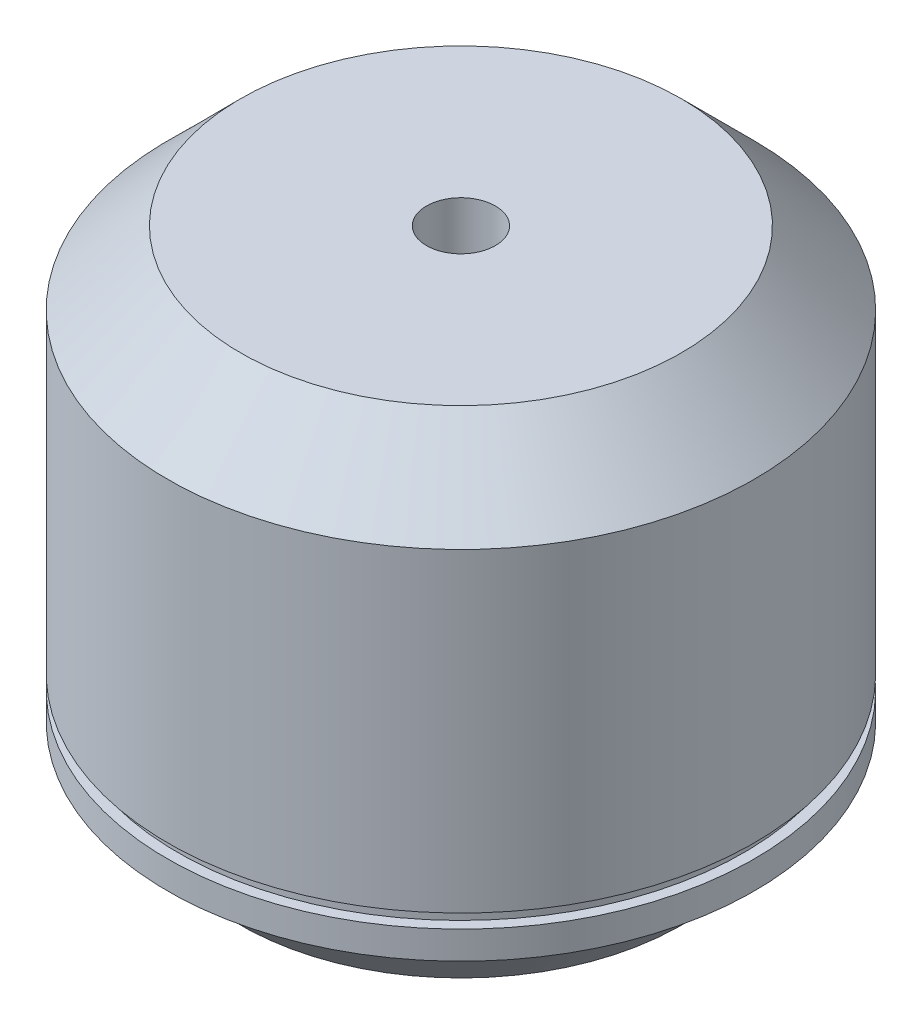
ISO-10303-21;
HEADER;
FILE_DESCRIPTION(('STEP AP214'),'2;1');
FILE_NAME('part.step','',(''),(''),'','','');
FILE_SCHEMA(('AUTOMOTIVE_DESIGN { 1 0 10303 214 1 1 1 1 }'));
ENDSEC;
DATA;
#1=APPLICATION_CONTEXT('core data for automotive mechanical design processes');
#2=APPLICATION_PROTOCOL_DEFINITION('international standard','automotive_design',2000,#1);
#3=PRODUCT_CONTEXT('',#1,'mechanical');
#4=PRODUCT('Part','Part','',(#3));
#5=PRODUCT_RELATED_PRODUCT_CATEGORY('part','',(#4));
#6=PRODUCT_DEFINITION_FORMATION('','',#4);
#7=PRODUCT_DEFINITION_CONTEXT('part definition',#1,'design');
#8=PRODUCT_DEFINITION('design','',#6,#7);
#9=PRODUCT_DEFINITION_SHAPE('','',#8);
#10=(LENGTH_UNIT() NAMED_UNIT(*) SI_UNIT(.MILLI.,.METRE.));
#11=(NAMED_UNIT(*) PLANE_ANGLE_UNIT() SI_UNIT($,.RADIAN.));
#12=(NAMED_UNIT(*) SI_UNIT($,.STERADIAN.) SOLID_ANGLE_UNIT());
#13=UNCERTAINTY_MEASURE_WITH_UNIT(LENGTH_MEASURE(1.E-05),#10,'distance_accuracy_value','');
#14=(GEOMETRIC_REPRESENTATION_CONTEXT(3) GLOBAL_UNCERTAINTY_ASSIGNED_CONTEXT((#13)) GLOBAL_UNIT_ASSIGNED_CONTEXT((#10,
#11,#12)) REPRESENTATION_CONTEXT('',''));
#15=CARTESIAN_POINT('',(0.,0.,0.));
#16=DIRECTION('',(0.,0.,1.));
#17=DIRECTION('',(1.,0.,0.));
#18=AXIS2_PLACEMENT_3D('',#15,#16,#17);
#19=CARTESIAN_POINT('',(16.,36.,0.));
#20=DIRECTION('',(0.,1.,0.));
#21=DIRECTION('',(0.,0.,1.));
#22=AXIS2_PLACEMENT_3D('',#19,#20,#21);
#23=PLANE('',#22);
#24=CARTESIAN_POINT('',(0.,36.,0.));
#25=DIRECTION('',(0.,-1.,0.));
#26=DIRECTION('',(0.,0.,-1.));
#27=AXIS2_PLACEMENT_3D('',#24,#25,#26);
#28=CIRCLE('',#27,2.5);
#29=CARTESIAN_POINT('',(0.,36.,-2.5));
#30=VERTEX_POINT('',#29);
#31=EDGE_CURVE('E10',#30,#30,#28,.T.);
#32=ORIENTED_EDGE('',*,*,#31,.T.);
#33=EDGE_LOOP('',(#32));
#34=FACE_BOUND('',#33,.T.);
#35=CARTESIAN_POINT('',(0.,36.,0.));
#36=DIRECTION('',(0.,-1.,0.));
#37=DIRECTION('',(0.,0.,-1.));
#38=AXIS2_PLACEMENT_3D('',#35,#36,#37);
#39=CIRCLE('',#38,16.);
#40=CARTESIAN_POINT('',(0.,36.,-16.));
#41=VERTEX_POINT('',#40);
#42=EDGE_CURVE('E73',#41,#41,#39,.T.);
#43=ORIENTED_EDGE('',*,*,#42,.F.);
#44=EDGE_LOOP('',(#43));
#45=FACE_BOUND('',#44,.T.);
#46=ADVANCED_FACE('F30',(#34,#45),#23,.T.);
#47=CARTESIAN_POINT('',(0.,0.,0.));
#48=DIRECTION('',(0.,-1.,0.));
#49=DIRECTION('',(0.,0.,-1.));
#50=AXIS2_PLACEMENT_3D('',#47,#48,#49);
#51=CYLINDRICAL_SURFACE('',#50,2.5);
#52=CARTESIAN_POINT('',(0.,1.,0.));
#53=DIRECTION('',(0.,-1.,0.));
#54=DIRECTION('',(0.,0.,-1.));
#55=AXIS2_PLACEMENT_3D('',#52,#53,#54);
#56=CIRCLE('',#55,2.5);
#57=CARTESIAN_POINT('',(0.,1.,-2.5));
#58=VERTEX_POINT('',#57);
#59=EDGE_CURVE('E36',#58,#58,#56,.T.);
#60=ORIENTED_EDGE('',*,*,#59,.T.);
#61=EDGE_LOOP('',(#60));
#62=FACE_BOUND('',#61,.T.);
#63=ORIENTED_EDGE('',*,*,#31,.F.);
#64=EDGE_LOOP('',(#63));
#65=FACE_BOUND('',#64,.T.);
#66=ADVANCED_FACE('F131',(#62,#65),#51,.F.);
#67=CARTESIAN_POINT('',(2.5,1.,0.));
#68=DIRECTION('',(0.,-1.,0.));
#69=DIRECTION('',(0.,0.,-1.));
#70=AXIS2_PLACEMENT_3D('',#67,#68,#69);
#71=PLANE('',#70);
#72=CARTESIAN_POINT('',(0.,1.,0.));
#73=DIRECTION('',(0.,-1.,0.));
#74=DIRECTION('',(0.,0.,-1.));
#75=AXIS2_PLACEMENT_3D('',#72,#73,#74);
#76=CIRCLE('',#75,8.);
#77=CARTESIAN_POINT('',(0.,1.,-8.));
#78=VERTEX_POINT('',#77);
#79=EDGE_CURVE('E40',#78,#78,#76,.T.);
#80=ORIENTED_EDGE('',*,*,#79,.T.);
#81=EDGE_LOOP('',(#80));
#82=FACE_BOUND('',#81,.T.);
#83=ORIENTED_EDGE('',*,*,#59,.F.);
#84=EDGE_LOOP('',(#83));
#85=FACE_BOUND('',#84,.T.);
#86=ADVANCED_FACE('F125',(#82,#85),#71,.T.);
#87=CARTESIAN_POINT('',(0.,0.,0.));
#88=DIRECTION('',(0.,-1.,0.));
#89=DIRECTION('',(0.,0.,-1.));
#90=AXIS2_PLACEMENT_3D('',#87,#88,#89);
#91=CYLINDRICAL_SURFACE('',#90,8.);
#92=CARTESIAN_POINT('',(0.,0.,0.));
#93=DIRECTION('',(0.,-1.,0.));
#94=DIRECTION('',(0.,0.,-1.));
#95=AXIS2_PLACEMENT_3D('',#92,#93,#94);
#96=CIRCLE('',#95,8.);
#97=CARTESIAN_POINT('',(0.,0.,-8.));
#98=VERTEX_POINT('',#97);
#99=EDGE_CURVE('E44',#98,#98,#96,.T.);
#100=ORIENTED_EDGE('',*,*,#99,.T.);
#101=EDGE_LOOP('',(#100));
#102=FACE_BOUND('',#101,.T.);
#103=ORIENTED_EDGE('',*,*,#79,.F.);
#104=EDGE_LOOP('',(#103));
#105=FACE_BOUND('',#104,.T.);
#106=ADVANCED_FACE('F114',(#102,#105),#91,.F.);
#107=CARTESIAN_POINT('',(8.,0.,0.));
#108=DIRECTION('',(0.,-1.,0.));
#109=DIRECTION('',(0.,0.,-1.));
#110=AXIS2_PLACEMENT_3D('',#107,#108,#109);
#111=PLANE('',#110);
#112=CARTESIAN_POINT('',(-8.83883476483184,0.,-8.83883476483185));
#113=DIRECTION('',(0.,-1.,0.));
#114=DIRECTION('',(0.,0.,-1.));
#115=AXIS2_PLACEMENT_3D('',#112,#113,#114);
#116=CIRCLE('',#115,1.5);
#117=CARTESIAN_POINT('',(-8.83883476483184,0.,-10.3388347648318));
#118=VERTEX_POINT('',#117);
#119=EDGE_CURVE('E83',#118,#118,#116,.T.);
#120=ORIENTED_EDGE('',*,*,#119,.F.);
#121=EDGE_LOOP('',(#120));
#122=FACE_BOUND('',#121,.T.);
#123=CARTESIAN_POINT('',(8.83883476483185,0.,-8.83883476483185));
#124=DIRECTION('',(0.,-1.,0.));
#125=DIRECTION('',(0.,0.,-1.));
#126=AXIS2_PLACEMENT_3D('',#123,#124,#125);
#127=CIRCLE('',#126,1.5);
#128=CARTESIAN_POINT('',(8.83883476483185,0.,-10.3388347648318));
#129=VERTEX_POINT('',#128);
#130=EDGE_CURVE('E89',#129,#129,#127,.T.);
#131=ORIENTED_EDGE('',*,*,#130,.F.);
#132=EDGE_LOOP('',(#131));
#133=FACE_BOUND('',#132,.T.);
#134=CARTESIAN_POINT('',(8.83883476483185,0.,8.83883476483184));
#135=DIRECTION('',(0.,-1.,0.));
#136=DIRECTION('',(0.,0.,-1.));
#137=AXIS2_PLACEMENT_3D('',#134,#135,#136);
#138=CIRCLE('',#137,1.5);
#139=CARTESIAN_POINT('',(8.83883476483185,0.,7.33883476483184));
#140=VERTEX_POINT('',#139);
#141=EDGE_CURVE('E95',#140,#140,#138,.T.);
#142=ORIENTED_EDGE('',*,*,#141,.F.);
#143=EDGE_LOOP('',(#142));
#144=FACE_BOUND('',#143,.T.);
#145=CARTESIAN_POINT('',(-8.83883476483184,0.,8.83883476483184));
#146=DIRECTION('',(0.,-1.,0.));
#147=DIRECTION('',(0.,0.,-1.));
#148=AXIS2_PLACEMENT_3D('',#145,#146,#147);
#149=CIRCLE('',#148,1.5);
#150=CARTESIAN_POINT('',(-8.83883476483184,0.,7.33883476483184));
#151=VERTEX_POINT('',#150);
#152=EDGE_CURVE('E77',#151,#151,#149,.T.);
#153=ORIENTED_EDGE('',*,*,#152,.F.);
#154=EDGE_LOOP('',(#153));
#155=FACE_BOUND('',#154,.T.);
#156=CARTESIAN_POINT('',(0.,0.,0.));
#157=DIRECTION('',(0.,-1.,0.));
#158=DIRECTION('',(0.,0.,-1.));
#159=AXIS2_PLACEMENT_3D('',#156,#157,#158);
#160=CIRCLE('',#159,16.);
#161=CARTESIAN_POINT('',(0.,0.,-16.));
#162=VERTEX_POINT('',#161);
#163=EDGE_CURVE('E49',#162,#162,#160,.T.);
#164=ORIENTED_EDGE('',*,*,#163,.T.);
#165=EDGE_LOOP('',(#164));
#166=FACE_BOUND('',#165,.T.);
#167=ORIENTED_EDGE('',*,*,#99,.F.);
#168=EDGE_LOOP('',(#167));
#169=FACE_BOUND('',#168,.T.);
#170=ADVANCED_FACE('F110',(#122,#133,#144,#155,#166,#169),#111,.T.);
#171=CARTESIAN_POINT('',(0.,0.,0.));
#172=DIRECTION('',(0.,1.,0.));
#173=DIRECTION('',(0.,0.,1.));
#174=AXIS2_PLACEMENT_3D('',#171,#172,#173);
#175=CONICAL_SURFACE('',#174,16.,0.785398163397447);
#176=CARTESIAN_POINT('',(0.,4.80000000000002,0.));
#177=DIRECTION('',(0.,-1.,0.));
#178=DIRECTION('',(0.,0.,-1.));
#179=AXIS2_PLACEMENT_3D('',#176,#177,#178);
#180=CIRCLE('',#179,20.8);
#181=CARTESIAN_POINT('',(0.,4.80000000000002,-20.8));
#182=VERTEX_POINT('',#181);
#183=EDGE_CURVE('E52',#182,#182,#180,.T.);
#184=ORIENTED_EDGE('',*,*,#183,.T.);
#185=EDGE_LOOP('',(#184));
#186=FACE_BOUND('',#185,.T.);
#187=ORIENTED_EDGE('',*,*,#163,.F.);
#188=EDGE_LOOP('',(#187));
#189=FACE_BOUND('',#188,.T.);
#190=ADVANCED_FACE('F113',(#186,#189),#175,.T.);
#191=CARTESIAN_POINT('',(20.8,4.80000000000002,0.));
#192=DIRECTION('',(0.,-1.,0.));
#193=DIRECTION('',(0.,0.,-1.));
#194=AXIS2_PLACEMENT_3D('',#191,#192,#193);
#195=PLANE('',#194);
#196=CARTESIAN_POINT('',(0.,4.80000000000002,0.));
#197=DIRECTION('',(0.,-1.,0.));
#198=DIRECTION('',(0.,0.,-1.));
#199=AXIS2_PLACEMENT_3D('',#196,#197,#198);
#200=CIRCLE('',#199,21.3);
#201=CARTESIAN_POINT('',(0.,4.80000000000002,-21.3));
#202=VERTEX_POINT('',#201);
#203=EDGE_CURVE('E55',#202,#202,#200,.T.);
#204=ORIENTED_EDGE('',*,*,#203,.T.);
#205=EDGE_LOOP('',(#204));
#206=FACE_BOUND('',#205,.T.);
#207=ORIENTED_EDGE('',*,*,#183,.F.);
#208=EDGE_LOOP('',(#207));
#209=FACE_BOUND('',#208,.T.);
#210=ADVANCED_FACE('F176',(#206,#209),#195,.T.);
#211=CARTESIAN_POINT('',(0.,0.,0.));
#212=DIRECTION('',(0.,-1.,0.));
#213=DIRECTION('',(0.,0.,-1.));
#214=AXIS2_PLACEMENT_3D('',#211,#212,#213);
#215=CYLINDRICAL_SURFACE('',#214,21.3);
#216=CARTESIAN_POINT('',(0.,6.82198055066473,0.));
#217=DIRECTION('',(0.,-1.,0.));
#218=DIRECTION('',(0.,0.,-1.));
#219=AXIS2_PLACEMENT_3D('',#216,#217,#218);
#220=CIRCLE('',#219,21.3);
#221=CARTESIAN_POINT('',(0.,6.82198055066473,-21.3));
#222=VERTEX_POINT('',#221);
#223=EDGE_CURVE('E58',#222,#222,#220,.T.);
#224=ORIENTED_EDGE('',*,*,#223,.T.);
#225=EDGE_LOOP('',(#224));
#226=FACE_BOUND('',#225,.T.);
#227=ORIENTED_EDGE('',*,*,#203,.F.);
#228=EDGE_LOOP('',(#227));
#229=FACE_BOUND('',#228,.T.);
#230=ADVANCED_FACE('F170',(#226,#229),#215,.T.);
#231=CARTESIAN_POINT('',(21.3,6.82198055066473,0.));
#232=DIRECTION('',(0.,1.,0.));
#233=DIRECTION('',(0.,0.,1.));
#234=AXIS2_PLACEMENT_3D('',#231,#232,#233);
#235=PLANE('',#234);
#236=CARTESIAN_POINT('',(0.,6.82198055066473,0.));
#237=DIRECTION('',(0.,-1.,0.));
#238=DIRECTION('',(0.,0.,-1.));
#239=AXIS2_PLACEMENT_3D('',#236,#237,#238);
#240=CIRCLE('',#239,20.529759761911);
#241=CARTESIAN_POINT('',(0.,6.82198055066473,-20.529759761911));
#242=VERTEX_POINT('',#241);
#243=EDGE_CURVE('E61',#242,#242,#240,.T.);
#244=ORIENTED_EDGE('',*,*,#243,.T.);
#245=EDGE_LOOP('',(#244));
#246=FACE_BOUND('',#245,.T.);
#247=ORIENTED_EDGE('',*,*,#223,.F.);
#248=EDGE_LOOP('',(#247));
#249=FACE_BOUND('',#248,.T.);
#250=ADVANCED_FACE('F164',(#246,#249),#235,.T.);
#251=CARTESIAN_POINT('',(0.,0.,0.));
#252=DIRECTION('',(0.,-1.,0.));
#253=DIRECTION('',(0.,0.,-1.));
#254=AXIS2_PLACEMENT_3D('',#251,#252,#253);
#255=CYLINDRICAL_SURFACE('',#254,20.529759761911);
#256=CARTESIAN_POINT('',(0.,7.83094919267474,0.));
#257=DIRECTION('',(0.,-1.,0.));
#258=DIRECTION('',(0.,0.,-1.));
#259=AXIS2_PLACEMENT_3D('',#256,#257,#258);
#260=CIRCLE('',#259,20.529759761911);
#261=CARTESIAN_POINT('',(0.,7.83094919267474,-20.529759761911));
#262=VERTEX_POINT('',#261);
#263=EDGE_CURVE('E64',#262,#262,#260,.T.);
#264=ORIENTED_EDGE('',*,*,#263,.T.);
#265=EDGE_LOOP('',(#264));
#266=FACE_BOUND('',#265,.T.);
#267=ORIENTED_EDGE('',*,*,#243,.F.);
#268=EDGE_LOOP('',(#267));
#269=FACE_BOUND('',#268,.T.);
#270=ADVANCED_FACE('F158',(#266,#269),#255,.T.);
#271=CARTESIAN_POINT('',(21.3,7.83094919267474,0.));
#272=DIRECTION('',(0.,-1.,0.));
#273=DIRECTION('',(0.,0.,-1.));
#274=AXIS2_PLACEMENT_3D('',#271,#272,#273);
#275=PLANE('',#274);
#276=CARTESIAN_POINT('',(0.,7.83094919267474,0.));
#277=DIRECTION('',(0.,-1.,0.));
#278=DIRECTION('',(0.,0.,-1.));
#279=AXIS2_PLACEMENT_3D('',#276,#277,#278);
#280=CIRCLE('',#279,21.3);
#281=CARTESIAN_POINT('',(0.,7.83094919267474,-21.3));
#282=VERTEX_POINT('',#281);
#283=EDGE_CURVE('E67',#282,#282,#280,.T.);
#284=ORIENTED_EDGE('',*,*,#283,.T.);
#285=EDGE_LOOP('',(#284));
#286=FACE_BOUND('',#285,.T.);
#287=ORIENTED_EDGE('',*,*,#263,.F.);
#288=EDGE_LOOP('',(#287));
#289=FACE_BOUND('',#288,.T.);
#290=ADVANCED_FACE('F152',(#286,#289),#275,.T.);
#291=CARTESIAN_POINT('',(0.,0.,0.));
#292=DIRECTION('',(0.,-1.,0.));
#293=DIRECTION('',(0.,0.,-1.));
#294=AXIS2_PLACEMENT_3D('',#291,#292,#293);
#295=CYLINDRICAL_SURFACE('',#294,21.3);
#296=CARTESIAN_POINT('',(0.,30.7,0.));
#297=DIRECTION('',(0.,-1.,0.));
#298=DIRECTION('',(0.,0.,-1.));
#299=AXIS2_PLACEMENT_3D('',#296,#297,#298);
#300=CIRCLE('',#299,21.3);
#301=CARTESIAN_POINT('',(0.,30.7,-21.3));
#302=VERTEX_POINT('',#301);
#303=EDGE_CURVE('E70',#302,#302,#300,.T.);
#304=ORIENTED_EDGE('',*,*,#303,.T.);
#305=EDGE_LOOP('',(#304));
#306=FACE_BOUND('',#305,.T.);
#307=ORIENTED_EDGE('',*,*,#283,.F.);
#308=EDGE_LOOP('',(#307));
#309=FACE_BOUND('',#308,.T.);
#310=ADVANCED_FACE('F146',(#306,#309),#295,.T.);
#311=CARTESIAN_POINT('',(0.,30.7,0.));
#312=DIRECTION('',(0.,-1.,0.));
#313=DIRECTION('',(0.,0.,-1.));
#314=AXIS2_PLACEMENT_3D('',#311,#312,#313);
#315=CONICAL_SURFACE('',#314,21.3,0.785398163397451);
#316=ORIENTED_EDGE('',*,*,#42,.T.);
#317=EDGE_LOOP('',(#316));
#318=FACE_BOUND('',#317,.T.);
#319=ORIENTED_EDGE('',*,*,#303,.F.);
#320=EDGE_LOOP('',(#319));
#321=FACE_BOUND('',#320,.T.);
#322=ADVANCED_FACE('F142',(#318,#321),#315,.T.);
#323=CARTESIAN_POINT('',(-8.83883476483184,5.,8.83883476483184));
#324=DIRECTION('',(0.,-1.,0.));
#325=DIRECTION('',(0.,0.,-1.));
#326=AXIS2_PLACEMENT_3D('',#323,#324,#325);
#327=CYLINDRICAL_SURFACE('',#326,1.5);
#328=CARTESIAN_POINT('',(-8.83883476483184,5.,8.83883476483184));
#329=DIRECTION('',(0.,-1.,0.));
#330=DIRECTION('',(0.,0.,-1.));
#331=AXIS2_PLACEMENT_3D('',#328,#329,#330);
#332=CIRCLE('',#331,1.5);
#333=CARTESIAN_POINT('',(-8.83883476483184,5.,7.33883476483184));
#334=VERTEX_POINT('',#333);
#335=EDGE_CURVE('E76',#334,#334,#332,.T.);
#336=ORIENTED_EDGE('',*,*,#335,.F.);
#337=EDGE_LOOP('',(#336));
#338=FACE_BOUND('',#337,.T.);
#339=ORIENTED_EDGE('',*,*,#152,.T.);
#340=EDGE_LOOP('',(#339));
#341=FACE_BOUND('',#340,.T.);
#342=ADVANCED_FACE('F145',(#338,#341),#327,.F.);
#343=CARTESIAN_POINT('',(-8.83883476483184,5.,8.83883476483184));
#344=DIRECTION('',(0.,-1.,0.));
#345=DIRECTION('',(0.,0.,-1.));
#346=AXIS2_PLACEMENT_3D('',#343,#344,#345);
#347=PLANE('',#346);
#348=ORIENTED_EDGE('',*,*,#335,.T.);
#349=EDGE_LOOP('',(#348));
#350=FACE_BOUND('',#349,.T.);
#351=ADVANCED_FACE('F106',(#350),#347,.T.);
#352=CARTESIAN_POINT('',(8.83883476483185,5.,8.83883476483184));
#353=DIRECTION('',(0.,-1.,0.));
#354=DIRECTION('',(0.,0.,-1.));
#355=AXIS2_PLACEMENT_3D('',#352,#353,#354);
#356=CYLINDRICAL_SURFACE('',#355,1.5);
#357=CARTESIAN_POINT('',(8.83883476483185,5.,8.83883476483184));
#358=DIRECTION('',(0.,-1.,0.));
#359=DIRECTION('',(0.,0.,-1.));
#360=AXIS2_PLACEMENT_3D('',#357,#358,#359);
#361=CIRCLE('',#360,1.5);
#362=CARTESIAN_POINT('',(8.83883476483185,5.,7.33883476483184));
#363=VERTEX_POINT('',#362);
#364=EDGE_CURVE('E80',#363,#363,#361,.T.);
#365=ORIENTED_EDGE('',*,*,#364,.F.);
#366=EDGE_LOOP('',(#365));
#367=FACE_BOUND('',#366,.T.);
#368=ORIENTED_EDGE('',*,*,#141,.T.);
#369=EDGE_LOOP('',(#368));
#370=FACE_BOUND('',#369,.T.);
#371=ADVANCED_FACE('F103',(#367,#370),#356,.F.);
#372=CARTESIAN_POINT('',(8.83883476483185,5.,8.83883476483184));
#373=DIRECTION('',(0.,-1.,0.));
#374=DIRECTION('',(0.,0.,-1.));
#375=AXIS2_PLACEMENT_3D('',#372,#373,#374);
#376=PLANE('',#375);
#377=ORIENTED_EDGE('',*,*,#364,.T.);
#378=EDGE_LOOP('',(#377));
#379=FACE_BOUND('',#378,.T.);
#380=ADVANCED_FACE('F101',(#379),#376,.T.);
#381=CARTESIAN_POINT('',(8.83883476483185,5.,-8.83883476483185));
#382=DIRECTION('',(0.,-1.,0.));
#383=DIRECTION('',(0.,0.,-1.));
#384=AXIS2_PLACEMENT_3D('',#381,#382,#383);
#385=CYLINDRICAL_SURFACE('',#384,1.5);
#386=CARTESIAN_POINT('',(8.83883476483185,5.,-8.83883476483185));
#387=DIRECTION('',(0.,-1.,0.));
#388=DIRECTION('',(0.,0.,-1.));
#389=AXIS2_PLACEMENT_3D('',#386,#387,#388);
#390=CIRCLE('',#389,1.5);
#391=CARTESIAN_POINT('',(8.83883476483185,5.,-10.3388347648318));
#392=VERTEX_POINT('',#391);
#393=EDGE_CURVE('E92',#392,#392,#390,.T.);
#394=ORIENTED_EDGE('',*,*,#393,.F.);
#395=EDGE_LOOP('',(#394));
#396=FACE_BOUND('',#395,.T.);
#397=ORIENTED_EDGE('',*,*,#130,.T.);
#398=EDGE_LOOP('',(#397));
#399=FACE_BOUND('',#398,.T.);
#400=ADVANCED_FACE('F206',(#396,#399),#385,.F.);
#401=CARTESIAN_POINT('',(8.83883476483185,5.,-8.83883476483185));
#402=DIRECTION('',(0.,-1.,0.));
#403=DIRECTION('',(0.,0.,-1.));
#404=AXIS2_PLACEMENT_3D('',#401,#402,#403);
#405=PLANE('',#404);
#406=ORIENTED_EDGE('',*,*,#393,.T.);
#407=EDGE_LOOP('',(#406));
#408=FACE_BOUND('',#407,.T.);
#409=ADVANCED_FACE('F201',(#408),#405,.T.);
#410=CARTESIAN_POINT('',(-8.83883476483184,5.,-8.83883476483185));
#411=DIRECTION('',(0.,-1.,0.));
#412=DIRECTION('',(0.,0.,-1.));
#413=AXIS2_PLACEMENT_3D('',#410,#411,#412);
#414=CYLINDRICAL_SURFACE('',#413,1.5);
#415=CARTESIAN_POINT('',(-8.83883476483184,5.,-8.83883476483185));
#416=DIRECTION('',(0.,-1.,0.));
#417=DIRECTION('',(0.,0.,-1.));
#418=AXIS2_PLACEMENT_3D('',#415,#416,#417);
#419=CIRCLE('',#418,1.5);
#420=CARTESIAN_POINT('',(-8.83883476483184,5.,-10.3388347648318));
#421=VERTEX_POINT('',#420);
#422=EDGE_CURVE('E86',#421,#421,#419,.T.);
#423=ORIENTED_EDGE('',*,*,#422,.F.);
#424=EDGE_LOOP('',(#423));
#425=FACE_BOUND('',#424,.T.);
#426=ORIENTED_EDGE('',*,*,#119,.T.);
#427=EDGE_LOOP('',(#426));
#428=FACE_BOUND('',#427,.T.);
#429=ADVANCED_FACE('F197',(#425,#428),#414,.F.);
#430=CARTESIAN_POINT('',(-8.83883476483184,5.,-8.83883476483185));
#431=DIRECTION('',(0.,-1.,0.));
#432=DIRECTION('',(0.,0.,-1.));
#433=AXIS2_PLACEMENT_3D('',#430,#431,#432);
#434=PLANE('',#433);
#435=ORIENTED_EDGE('',*,*,#422,.T.);
#436=EDGE_LOOP('',(#435));
#437=FACE_BOUND('',#436,.T.);
#438=ADVANCED_FACE('F200',(#437),#434,.T.);
#439=CLOSED_SHELL('',(#46,#66,#86,#106,#170,#190,#210,#230,#250,#270,#290,#310,#322,#342,#351,
#371,#380,#400,#409,#429,#438));
#440=MANIFOLD_SOLID_BREP('B2',#439);
#441=ADVANCED_BREP_SHAPE_REPRESENTATION('',(#18,#440),#14);
#442=SHAPE_DEFINITION_REPRESENTATION(#9,#441);
ENDSEC;
END-ISO-10303-21;
